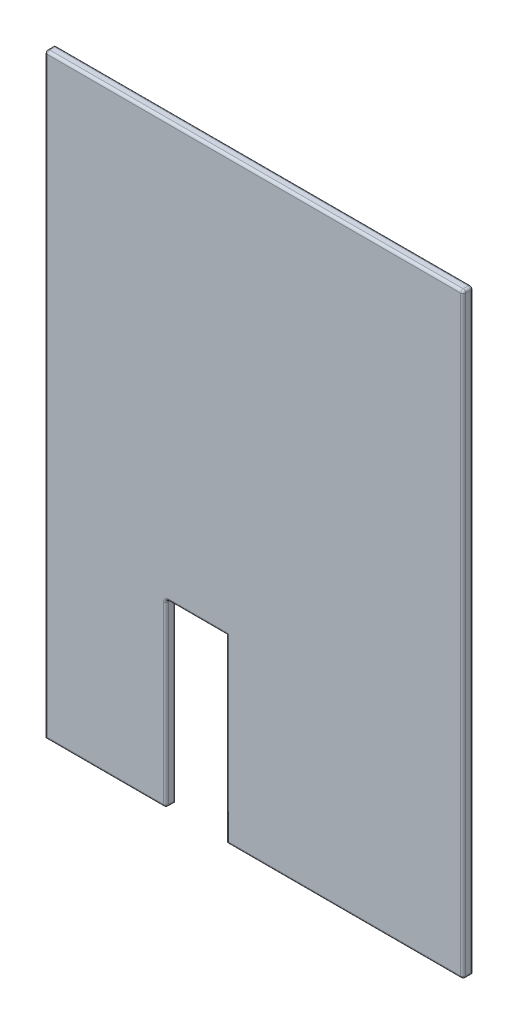
ISO-10303-21;
HEADER;
FILE_DESCRIPTION(('STEP AP214'),'2;1');
FILE_NAME('part.step','',(''),(''),'','','');
FILE_SCHEMA(('AUTOMOTIVE_DESIGN { 1 0 10303 214 1 1 1 1 }'));
ENDSEC;
DATA;
#1=APPLICATION_CONTEXT('core data for automotive mechanical design processes');
#2=APPLICATION_PROTOCOL_DEFINITION('international standard','automotive_design',2000,#1);
#3=PRODUCT_CONTEXT('',#1,'mechanical');
#4=PRODUCT('Part','Part','',(#3));
#5=PRODUCT_RELATED_PRODUCT_CATEGORY('part','',(#4));
#6=PRODUCT_DEFINITION_FORMATION('','',#4);
#7=PRODUCT_DEFINITION_CONTEXT('part definition',#1,'design');
#8=PRODUCT_DEFINITION('design','',#6,#7);
#9=PRODUCT_DEFINITION_SHAPE('','',#8);
#10=(LENGTH_UNIT() NAMED_UNIT(*) SI_UNIT(.MILLI.,.METRE.));
#11=(NAMED_UNIT(*) PLANE_ANGLE_UNIT() SI_UNIT($,.RADIAN.));
#12=(NAMED_UNIT(*) SI_UNIT($,.STERADIAN.) SOLID_ANGLE_UNIT());
#13=UNCERTAINTY_MEASURE_WITH_UNIT(LENGTH_MEASURE(1.E-05),#10,'distance_accuracy_value','');
#14=(GEOMETRIC_REPRESENTATION_CONTEXT(3) GLOBAL_UNCERTAINTY_ASSIGNED_CONTEXT((#13)) GLOBAL_UNIT_ASSIGNED_CONTEXT((#10,
#11,#12)) REPRESENTATION_CONTEXT('',''));
#15=CARTESIAN_POINT('',(0.,0.,0.));
#16=DIRECTION('',(0.,0.,1.));
#17=DIRECTION('',(1.,0.,0.));
#18=AXIS2_PLACEMENT_3D('',#15,#16,#17);
#19=CARTESIAN_POINT('',(-55.5,-595.,20.));
#20=DIRECTION('',(0.,1.,0.));
#21=DIRECTION('',(0.,0.,1.));
#22=AXIS2_PLACEMENT_3D('',#19,#20,#21);
#23=PLANE('',#22);
#24=DIRECTION('',(0.,0.,-1.));
#25=VECTOR('',#24,1.);
#26=CARTESIAN_POINT('',(412.5,-595.,20.));
#27=LINE('',#26,#25);
#28=CARTESIAN_POINT('',(412.5,-595.,0.));
#29=VERTEX_POINT('',#28);
#30=CARTESIAN_POINT('',(412.5,-595.,15.));
#31=VERTEX_POINT('',#30);
#32=EDGE_CURVE('E303',#29,#31,#27,.F.);
#33=ORIENTED_EDGE('',*,*,#32,.T.);
#34=DIRECTION('',(1.,0.,0.));
#35=VECTOR('',#34,1.);
#36=CARTESIAN_POINT('',(-55.5,-595.,15.));
#37=LINE('',#36,#35);
#38=CARTESIAN_POINT('',(-55.5,-595.,15.));
#39=VERTEX_POINT('',#38);
#40=EDGE_CURVE('E306',#31,#39,#37,.F.);
#41=ORIENTED_EDGE('',*,*,#40,.T.);
#42=DIRECTION('',(0.,0.,-1.));
#43=VECTOR('',#42,1.);
#44=CARTESIAN_POINT('',(-55.5,-595.,20.));
#45=LINE('',#44,#43);
#46=CARTESIAN_POINT('',(-55.5,-595.,0.));
#47=VERTEX_POINT('',#46);
#48=EDGE_CURVE('E202',#39,#47,#45,.T.);
#49=ORIENTED_EDGE('',*,*,#48,.T.);
#50=DIRECTION('',(1.,0.,0.));
#51=VECTOR('',#50,1.);
#52=CARTESIAN_POINT('',(-55.5,-595.,0.));
#53=LINE('',#52,#51);
#54=EDGE_CURVE('E192',#47,#29,#53,.T.);
#55=ORIENTED_EDGE('',*,*,#54,.T.);
#56=EDGE_LOOP('',(#33,#41,#49,#55));
#57=FACE_BOUND('',#56,.T.);
#58=ADVANCED_FACE('F39',(#57),#23,.F.);
#59=CARTESIAN_POINT('',(417.5,595.,20.));
#60=DIRECTION('',(-1.,0.,0.));
#61=DIRECTION('',(0.,-1.,0.));
#62=AXIS2_PLACEMENT_3D('',#59,#60,#61);
#63=PLANE('',#62);
#64=DIRECTION('',(0.,1.,0.));
#65=VECTOR('',#64,1.);
#66=CARTESIAN_POINT('',(417.5,595.,5.));
#67=LINE('',#66,#65);
#68=CARTESIAN_POINT('',(417.5,-590.,5.));
#69=VERTEX_POINT('',#68);
#70=CARTESIAN_POINT('',(417.5,590.,5.));
#71=VERTEX_POINT('',#70);
#72=EDGE_CURVE('E241',#69,#71,#67,.T.);
#73=ORIENTED_EDGE('',*,*,#72,.T.);
#74=DIRECTION('',(0.,0.,-1.));
#75=VECTOR('',#74,1.);
#76=CARTESIAN_POINT('',(417.5,590.,20.));
#77=LINE('',#76,#75);
#78=CARTESIAN_POINT('',(417.5,590.,15.));
#79=VERTEX_POINT('',#78);
#80=EDGE_CURVE('E245',#71,#79,#77,.F.);
#81=ORIENTED_EDGE('',*,*,#80,.T.);
#82=DIRECTION('',(0.,1.,0.));
#83=VECTOR('',#82,1.);
#84=CARTESIAN_POINT('',(417.5,595.,15.));
#85=LINE('',#84,#83);
#86=CARTESIAN_POINT('',(417.5,-590.,15.));
#87=VERTEX_POINT('',#86);
#88=EDGE_CURVE('E238',#79,#87,#85,.F.);
#89=ORIENTED_EDGE('',*,*,#88,.T.);
#90=DIRECTION('',(0.,0.,-1.));
#91=VECTOR('',#90,1.);
#92=CARTESIAN_POINT('',(417.5,-590.,20.));
#93=LINE('',#92,#91);
#94=EDGE_CURVE('E235',#87,#69,#93,.T.);
#95=ORIENTED_EDGE('',*,*,#94,.T.);
#96=EDGE_LOOP('',(#73,#81,#89,#95));
#97=FACE_BOUND('',#96,.T.);
#98=ADVANCED_FACE('F518',(#97),#63,.F.);
#99=CARTESIAN_POINT('',(-417.5,595.,20.));
#100=DIRECTION('',(0.,-1.,0.));
#101=DIRECTION('',(0.,0.,-1.));
#102=AXIS2_PLACEMENT_3D('',#99,#100,#101);
#103=PLANE('',#102);
#104=DIRECTION('',(-1.,0.,0.));
#105=VECTOR('',#104,1.);
#106=CARTESIAN_POINT('',(-417.5,595.,5.));
#107=LINE('',#106,#105);
#108=CARTESIAN_POINT('',(412.5,595.,5.));
#109=VERTEX_POINT('',#108);
#110=CARTESIAN_POINT('',(-412.5,595.,5.));
#111=VERTEX_POINT('',#110);
#112=EDGE_CURVE('E254',#109,#111,#107,.T.);
#113=ORIENTED_EDGE('',*,*,#112,.T.);
#114=DIRECTION('',(0.,0.,-1.));
#115=VECTOR('',#114,1.);
#116=CARTESIAN_POINT('',(-412.5,595.,20.));
#117=LINE('',#116,#115);
#118=CARTESIAN_POINT('',(-412.5,595.,15.));
#119=VERTEX_POINT('',#118);
#120=EDGE_CURVE('E258',#111,#119,#117,.F.);
#121=ORIENTED_EDGE('',*,*,#120,.T.);
#122=DIRECTION('',(-1.,0.,0.));
#123=VECTOR('',#122,1.);
#124=CARTESIAN_POINT('',(-417.5,595.,15.));
#125=LINE('',#124,#123);
#126=CARTESIAN_POINT('',(412.5,595.,15.));
#127=VERTEX_POINT('',#126);
#128=EDGE_CURVE('E251',#119,#127,#125,.F.);
#129=ORIENTED_EDGE('',*,*,#128,.T.);
#130=DIRECTION('',(0.,0.,-1.));
#131=VECTOR('',#130,1.);
#132=CARTESIAN_POINT('',(412.5,595.,20.));
#133=LINE('',#132,#131);
#134=EDGE_CURVE('E248',#127,#109,#133,.T.);
#135=ORIENTED_EDGE('',*,*,#134,.T.);
#136=EDGE_LOOP('',(#113,#121,#129,#135));
#137=FACE_BOUND('',#136,.T.);
#138=ADVANCED_FACE('F504',(#137),#103,.F.);
#139=CARTESIAN_POINT('',(-417.5,595.,20.));
#140=DIRECTION('',(1.,0.,0.));
#141=DIRECTION('',(0.,1.,0.));
#142=AXIS2_PLACEMENT_3D('',#139,#140,#141);
#143=PLANE('',#142);
#144=DIRECTION('',(0.,0.,-1.));
#145=VECTOR('',#144,1.);
#146=CARTESIAN_POINT('',(-417.5,-595.,20.));
#147=LINE('',#146,#145);
#148=CARTESIAN_POINT('',(-417.5,-595.,15.));
#149=VERTEX_POINT('',#148);
#150=CARTESIAN_POINT('',(-417.5,-595.,0.));
#151=VERTEX_POINT('',#150);
#152=EDGE_CURVE('E175',#149,#151,#147,.T.);
#153=ORIENTED_EDGE('',*,*,#152,.F.);
#154=DIRECTION('',(0.,-1.,0.));
#155=VECTOR('',#154,1.);
#156=CARTESIAN_POINT('',(-417.5,595.,15.));
#157=LINE('',#156,#155);
#158=CARTESIAN_POINT('',(-417.5,590.,15.));
#159=VERTEX_POINT('',#158);
#160=EDGE_CURVE('E65',#149,#159,#157,.F.);
#161=ORIENTED_EDGE('',*,*,#160,.T.);
#162=DIRECTION('',(0.,0.,-1.));
#163=VECTOR('',#162,1.);
#164=CARTESIAN_POINT('',(-417.5,590.,20.));
#165=LINE('',#164,#163);
#166=CARTESIAN_POINT('',(-417.5,590.,0.));
#167=VERTEX_POINT('',#166);
#168=EDGE_CURVE('E188',#159,#167,#165,.T.);
#169=ORIENTED_EDGE('',*,*,#168,.T.);
#170=DIRECTION('',(0.,-1.,0.));
#171=VECTOR('',#170,1.);
#172=CARTESIAN_POINT('',(-417.5,595.,0.));
#173=LINE('',#172,#171);
#174=EDGE_CURVE('E186',#167,#151,#173,.T.);
#175=ORIENTED_EDGE('',*,*,#174,.T.);
#176=EDGE_LOOP('',(#153,#161,#169,#175));
#177=FACE_BOUND('',#176,.T.);
#178=ADVANCED_FACE('F187',(#177),#143,.F.);
#179=CARTESIAN_POINT('',(-417.5,-595.,20.));
#180=DIRECTION('',(0.,1.,0.));
#181=DIRECTION('',(0.,0.,1.));
#182=AXIS2_PLACEMENT_3D('',#179,#180,#181);
#183=PLANE('',#182);
#184=DIRECTION('',(0.,0.,-1.));
#185=VECTOR('',#184,1.);
#186=CARTESIAN_POINT('',(-180.5,-595.,20.));
#187=LINE('',#186,#185);
#188=CARTESIAN_POINT('',(-180.5,-595.,0.));
#189=VERTEX_POINT('',#188);
#190=CARTESIAN_POINT('',(-180.5,-595.,15.));
#191=VERTEX_POINT('',#190);
#192=EDGE_CURVE('E57',#189,#191,#187,.F.);
#193=ORIENTED_EDGE('',*,*,#192,.T.);
#194=DIRECTION('',(1.,0.,0.));
#195=VECTOR('',#194,1.);
#196=CARTESIAN_POINT('',(-417.5,-595.,15.));
#197=LINE('',#196,#195);
#198=EDGE_CURVE('E180',#191,#149,#197,.F.);
#199=ORIENTED_EDGE('',*,*,#198,.T.);
#200=ORIENTED_EDGE('',*,*,#152,.T.);
#201=DIRECTION('',(1.,0.,0.));
#202=VECTOR('',#201,1.);
#203=CARTESIAN_POINT('',(-417.5,-595.,0.));
#204=LINE('',#203,#202);
#205=EDGE_CURVE('E179',#151,#189,#204,.T.);
#206=ORIENTED_EDGE('',*,*,#205,.T.);
#207=EDGE_LOOP('',(#193,#199,#200,#206));
#208=FACE_BOUND('',#207,.T.);
#209=ADVANCED_FACE('F177',(#208),#183,.F.);
#210=CARTESIAN_POINT('',(-175.5,-595.,20.));
#211=DIRECTION('',(-1.,0.,0.));
#212=DIRECTION('',(0.,0.,1.));
#213=AXIS2_PLACEMENT_3D('',#210,#211,#212);
#214=PLANE('',#213);
#215=DIRECTION('',(0.,1.,0.));
#216=VECTOR('',#215,1.);
#217=CARTESIAN_POINT('',(-175.5,-235.,5.));
#218=LINE('',#217,#216);
#219=CARTESIAN_POINT('',(-175.5,-590.,5.));
#220=VERTEX_POINT('',#219);
#221=CARTESIAN_POINT('',(-175.5,-240.,5.));
#222=VERTEX_POINT('',#221);
#223=EDGE_CURVE('E267',#220,#222,#218,.T.);
#224=ORIENTED_EDGE('',*,*,#223,.T.);
#225=DIRECTION('',(0.,0.,-1.));
#226=VECTOR('',#225,1.);
#227=CARTESIAN_POINT('',(-175.5,-240.,20.));
#228=LINE('',#227,#226);
#229=CARTESIAN_POINT('',(-175.5,-240.,15.));
#230=VERTEX_POINT('',#229);
#231=EDGE_CURVE('E271',#222,#230,#228,.F.);
#232=ORIENTED_EDGE('',*,*,#231,.T.);
#233=DIRECTION('',(0.,1.,0.));
#234=VECTOR('',#233,1.);
#235=CARTESIAN_POINT('',(-175.5,-595.,15.));
#236=LINE('',#235,#234);
#237=CARTESIAN_POINT('',(-175.5,-590.,15.));
#238=VERTEX_POINT('',#237);
#239=EDGE_CURVE('E264',#230,#238,#236,.F.);
#240=ORIENTED_EDGE('',*,*,#239,.T.);
#241=DIRECTION('',(0.,0.,-1.));
#242=VECTOR('',#241,1.);
#243=CARTESIAN_POINT('',(-175.5,-590.,20.));
#244=LINE('',#243,#242);
#245=EDGE_CURVE('E261',#238,#220,#244,.T.);
#246=ORIENTED_EDGE('',*,*,#245,.T.);
#247=EDGE_LOOP('',(#224,#232,#240,#246));
#248=FACE_BOUND('',#247,.T.);
#249=ADVANCED_FACE('F595',(#248),#214,.F.);
#250=CARTESIAN_POINT('',(-175.5,-235.,20.));
#251=DIRECTION('',(0.,1.,0.));
#252=DIRECTION('',(-1.,0.,0.));
#253=AXIS2_PLACEMENT_3D('',#250,#251,#252);
#254=PLANE('',#253);
#255=DIRECTION('',(0.,0.,-1.));
#256=VECTOR('',#255,1.);
#257=CARTESIAN_POINT('',(-170.5,-235.,0.));
#258=LINE('',#257,#256);
#259=CARTESIAN_POINT('',(-170.5,-235.,15.));
#260=VERTEX_POINT('',#259);
#261=CARTESIAN_POINT('',(-170.5,-235.,5.));
#262=VERTEX_POINT('',#261);
#263=EDGE_CURVE('E182',#260,#262,#258,.T.);
#264=ORIENTED_EDGE('',*,*,#263,.T.);
#265=DIRECTION('',(1.,0.,0.));
#266=VECTOR('',#265,1.);
#267=CARTESIAN_POINT('',(-55.5000000000001,-235.,5.));
#268=LINE('',#267,#266);
#269=CARTESIAN_POINT('',(-55.5000000000001,-235.,5.));
#270=VERTEX_POINT('',#269);
#271=EDGE_CURVE('E216',#262,#270,#268,.T.);
#272=ORIENTED_EDGE('',*,*,#271,.T.);
#273=DIRECTION('',(0.,0.,-1.));
#274=VECTOR('',#273,1.);
#275=CARTESIAN_POINT('',(-55.5000000000001,-235.,20.));
#276=LINE('',#275,#274);
#277=CARTESIAN_POINT('',(-55.5000000000001,-235.,15.));
#278=VERTEX_POINT('',#277);
#279=EDGE_CURVE('E183',#278,#270,#276,.T.);
#280=ORIENTED_EDGE('',*,*,#279,.F.);
#281=DIRECTION('',(1.,0.,0.));
#282=VECTOR('',#281,1.);
#283=CARTESIAN_POINT('',(-175.5,-235.,15.));
#284=LINE('',#283,#282);
#285=EDGE_CURVE('E213',#278,#260,#284,.F.);
#286=ORIENTED_EDGE('',*,*,#285,.T.);
#287=EDGE_LOOP('',(#264,#272,#280,#286));
#288=FACE_BOUND('',#287,.T.);
#289=ADVANCED_FACE('F465',(#288),#254,.F.);
#290=CARTESIAN_POINT('',(-55.5000000000001,-235.,20.));
#291=DIRECTION('',(1.,0.,0.));
#292=DIRECTION('',(0.,1.,0.));
#293=AXIS2_PLACEMENT_3D('',#290,#291,#292);
#294=PLANE('',#293);
#295=ORIENTED_EDGE('',*,*,#48,.F.);
#296=DIRECTION('',(0.,-1.,0.));
#297=VECTOR('',#296,1.);
#298=CARTESIAN_POINT('',(-55.5000000000001,-235.,15.));
#299=LINE('',#298,#297);
#300=EDGE_CURVE('E49',#39,#278,#299,.F.);
#301=ORIENTED_EDGE('',*,*,#300,.T.);
#302=ORIENTED_EDGE('',*,*,#279,.T.);
#303=CARTESIAN_POINT('',(-55.5000000000001,-230.,5.));
#304=DIRECTION('',(1.,0.,0.));
#305=DIRECTION('',(0.,1.,0.));
#306=AXIS2_PLACEMENT_3D('',#303,#304,#305);
#307=CIRCLE('',#306,5.);
#308=CARTESIAN_POINT('',(-55.5000000000001,-230.,0.));
#309=VERTEX_POINT('',#308);
#310=EDGE_CURVE('E11',#270,#309,#307,.T.);
#311=ORIENTED_EDGE('',*,*,#310,.T.);
#312=DIRECTION('',(0.,-1.,0.));
#313=VECTOR('',#312,1.);
#314=CARTESIAN_POINT('',(-55.5000000000001,-235.,0.));
#315=LINE('',#314,#313);
#316=EDGE_CURVE('E198',#309,#47,#315,.T.);
#317=ORIENTED_EDGE('',*,*,#316,.T.);
#318=EDGE_LOOP('',(#295,#301,#302,#311,#317));
#319=FACE_BOUND('',#318,.T.);
#320=ADVANCED_FACE('F454',(#319),#294,.F.);
#321=CARTESIAN_POINT('',(0.,0.,20.));
#322=DIRECTION('',(0.,0.,-1.));
#323=DIRECTION('',(-1.,0.,0.));
#324=AXIS2_PLACEMENT_3D('',#321,#322,#323);
#325=PLANE('',#324);
#326=DIRECTION('',(0.,-1.,0.));
#327=VECTOR('',#326,1.);
#328=CARTESIAN_POINT('',(-50.5000000000002,0.,20.));
#329=LINE('',#328,#327);
#330=CARTESIAN_POINT('',(-50.5000000000001,-230.,20.));
#331=VERTEX_POINT('',#330);
#332=CARTESIAN_POINT('',(-50.5,-590.,20.));
#333=VERTEX_POINT('',#332);
#334=EDGE_CURVE('E274',#331,#333,#329,.T.);
#335=ORIENTED_EDGE('',*,*,#334,.T.);
#336=DIRECTION('',(1.,0.,0.));
#337=VECTOR('',#336,1.);
#338=CARTESIAN_POINT('',(0.,-590.,20.));
#339=LINE('',#338,#337);
#340=CARTESIAN_POINT('',(412.5,-590.,20.));
#341=VERTEX_POINT('',#340);
#342=EDGE_CURVE('E299',#333,#341,#339,.T.);
#343=ORIENTED_EDGE('',*,*,#342,.T.);
#344=DIRECTION('',(0.,1.,0.));
#345=VECTOR('',#344,1.);
#346=CARTESIAN_POINT('',(412.5,0.,20.));
#347=LINE('',#346,#345);
#348=CARTESIAN_POINT('',(412.5,590.,20.));
#349=VERTEX_POINT('',#348);
#350=EDGE_CURVE('E296',#341,#349,#347,.T.);
#351=ORIENTED_EDGE('',*,*,#350,.T.);
#352=DIRECTION('',(-1.,0.,0.));
#353=VECTOR('',#352,1.);
#354=CARTESIAN_POINT('',(0.,590.,20.));
#355=LINE('',#354,#353);
#356=CARTESIAN_POINT('',(-412.5,590.,20.));
#357=VERTEX_POINT('',#356);
#358=EDGE_CURVE('E293',#349,#357,#355,.T.);
#359=ORIENTED_EDGE('',*,*,#358,.T.);
#360=DIRECTION('',(0.,-1.,0.));
#361=VECTOR('',#360,1.);
#362=CARTESIAN_POINT('',(-412.5,0.,20.));
#363=LINE('',#362,#361);
#364=CARTESIAN_POINT('',(-412.5,-590.,20.));
#365=VERTEX_POINT('',#364);
#366=EDGE_CURVE('E290',#357,#365,#363,.T.);
#367=ORIENTED_EDGE('',*,*,#366,.T.);
#368=DIRECTION('',(1.,0.,0.));
#369=VECTOR('',#368,1.);
#370=CARTESIAN_POINT('',(0.,-590.,20.));
#371=LINE('',#370,#369);
#372=CARTESIAN_POINT('',(-180.5,-590.,20.));
#373=VERTEX_POINT('',#372);
#374=EDGE_CURVE('E287',#365,#373,#371,.T.);
#375=ORIENTED_EDGE('',*,*,#374,.T.);
#376=DIRECTION('',(0.,1.,0.));
#377=VECTOR('',#376,1.);
#378=CARTESIAN_POINT('',(-180.5,0.,20.));
#379=LINE('',#378,#377);
#380=CARTESIAN_POINT('',(-180.5,-240.,20.));
#381=VERTEX_POINT('',#380);
#382=EDGE_CURVE('E284',#373,#381,#379,.T.);
#383=ORIENTED_EDGE('',*,*,#382,.T.);
#384=CARTESIAN_POINT('',(-170.5,-240.,20.));
#385=DIRECTION('',(0.,0.,-1.));
#386=DIRECTION('',(-1.,0.,0.));
#387=AXIS2_PLACEMENT_3D('',#384,#385,#386);
#388=CIRCLE('',#387,10.);
#389=CARTESIAN_POINT('',(-170.5,-230.,20.));
#390=VERTEX_POINT('',#389);
#391=EDGE_CURVE('E280',#390,#381,#388,.F.);
#392=ORIENTED_EDGE('',*,*,#391,.F.);
#393=DIRECTION('',(1.,0.,0.));
#394=VECTOR('',#393,1.);
#395=CARTESIAN_POINT('',(0.,-230.,20.));
#396=LINE('',#395,#394);
#397=EDGE_CURVE('E277',#390,#331,#396,.T.);
#398=ORIENTED_EDGE('',*,*,#397,.T.);
#399=EDGE_LOOP('',(#335,#343,#351,#359,#367,#375,#383,#392,#398));
#400=FACE_BOUND('',#399,.T.);
#401=ADVANCED_FACE('F588',(#400),#325,.F.);
#402=CARTESIAN_POINT('',(0.,0.,0.));
#403=DIRECTION('',(0.,0.,-1.));
#404=DIRECTION('',(-1.,0.,0.));
#405=AXIS2_PLACEMENT_3D('',#402,#403,#404);
#406=PLANE('',#405);
#407=DIRECTION('',(-1.,0.,0.));
#408=VECTOR('',#407,1.);
#409=CARTESIAN_POINT('',(417.5,590.,0.));
#410=LINE('',#409,#408);
#411=CARTESIAN_POINT('',(412.5,590.,0.));
#412=VERTEX_POINT('',#411);
#413=EDGE_CURVE('E229',#167,#412,#410,.F.);
#414=ORIENTED_EDGE('',*,*,#413,.T.);
#415=DIRECTION('',(0.,1.,0.));
#416=VECTOR('',#415,1.);
#417=CARTESIAN_POINT('',(412.5,-595.,0.));
#418=LINE('',#417,#416);
#419=EDGE_CURVE('E232',#412,#29,#418,.F.);
#420=ORIENTED_EDGE('',*,*,#419,.T.);
#421=ORIENTED_EDGE('',*,*,#54,.F.);
#422=ORIENTED_EDGE('',*,*,#316,.F.);
#423=DIRECTION('',(1.,0.,0.));
#424=VECTOR('',#423,1.);
#425=CARTESIAN_POINT('',(-175.5,-230.,0.));
#426=LINE('',#425,#424);
#427=CARTESIAN_POINT('',(-170.5,-230.,0.));
#428=VERTEX_POINT('',#427);
#429=EDGE_CURVE('E226',#309,#428,#426,.F.);
#430=ORIENTED_EDGE('',*,*,#429,.T.);
#431=CARTESIAN_POINT('',(-170.5,-240.,0.));
#432=DIRECTION('',(0.,0.,-1.));
#433=DIRECTION('',(-1.,0.,0.));
#434=AXIS2_PLACEMENT_3D('',#431,#432,#433);
#435=CIRCLE('',#434,10.);
#436=CARTESIAN_POINT('',(-180.5,-240.,0.));
#437=VERTEX_POINT('',#436);
#438=EDGE_CURVE('E222',#437,#428,#435,.T.);
#439=ORIENTED_EDGE('',*,*,#438,.F.);
#440=DIRECTION('',(0.,1.,0.));
#441=VECTOR('',#440,1.);
#442=CARTESIAN_POINT('',(-180.5,-595.,0.));
#443=LINE('',#442,#441);
#444=EDGE_CURVE('E196',#437,#189,#443,.F.);
#445=ORIENTED_EDGE('',*,*,#444,.T.);
#446=ORIENTED_EDGE('',*,*,#205,.F.);
#447=ORIENTED_EDGE('',*,*,#174,.F.);
#448=EDGE_LOOP('',(#414,#420,#421,#422,#430,#439,#445,#446,#447));
#449=FACE_BOUND('',#448,.T.);
#450=ADVANCED_FACE('F194',(#449),#406,.T.);
#451=CARTESIAN_POINT('',(412.5,590.,20.));
#452=DIRECTION('',(0.,0.,-1.));
#453=DIRECTION('',(-1.,0.,0.));
#454=AXIS2_PLACEMENT_3D('',#451,#452,#453);
#455=CYLINDRICAL_SURFACE('',#454,5.);
#456=CARTESIAN_POINT('',(412.5,590.,5.));
#457=DIRECTION('',(0.,0.,-1.));
#458=DIRECTION('',(-1.,0.,0.));
#459=AXIS2_PLACEMENT_3D('',#456,#457,#458);
#460=CIRCLE('',#459,5.);
#461=EDGE_CURVE('E43',#109,#71,#460,.T.);
#462=ORIENTED_EDGE('',*,*,#461,.F.);
#463=ORIENTED_EDGE('',*,*,#134,.F.);
#464=CARTESIAN_POINT('',(412.5,590.,15.));
#465=DIRECTION('',(0.,0.,1.));
#466=DIRECTION('',(1.,0.,0.));
#467=AXIS2_PLACEMENT_3D('',#464,#465,#466);
#468=CIRCLE('',#467,5.);
#469=EDGE_CURVE('E412',#79,#127,#468,.T.);
#470=ORIENTED_EDGE('',*,*,#469,.F.);
#471=ORIENTED_EDGE('',*,*,#80,.F.);
#472=EDGE_LOOP('',(#462,#463,#470,#471));
#473=FACE_BOUND('',#472,.T.);
#474=ADVANCED_FACE('F41',(#473),#455,.T.);
#475=CARTESIAN_POINT('',(412.5,590.,5.));
#476=DIRECTION('',(0.,1.,0.));
#477=DIRECTION('',(0.,0.,1.));
#478=AXIS2_PLACEMENT_3D('',#475,#476,#477);
#479=SPHERICAL_SURFACE('',#478,5.);
#480=CARTESIAN_POINT('',(412.5,590.,5.));
#481=DIRECTION('',(0.,1.,0.));
#482=DIRECTION('',(0.,0.,1.));
#483=AXIS2_PLACEMENT_3D('',#480,#481,#482);
#484=CIRCLE('',#483,5.);
#485=EDGE_CURVE('E409',#412,#71,#484,.F.);
#486=ORIENTED_EDGE('',*,*,#485,.F.);
#487=CARTESIAN_POINT('',(412.5,590.,5.));
#488=DIRECTION('',(1.,0.,0.));
#489=DIRECTION('',(0.,0.,-1.));
#490=AXIS2_PLACEMENT_3D('',#487,#488,#489);
#491=CIRCLE('',#490,5.);
#492=EDGE_CURVE('E415',#109,#412,#491,.F.);
#493=ORIENTED_EDGE('',*,*,#492,.F.);
#494=ORIENTED_EDGE('',*,*,#461,.T.);
#495=EDGE_LOOP('',(#486,#493,#494));
#496=FACE_BOUND('',#495,.T.);
#497=ADVANCED_FACE('F509',(#496),#479,.T.);
#498=CARTESIAN_POINT('',(-417.5,590.,5.));
#499=DIRECTION('',(1.,0.,0.));
#500=DIRECTION('',(0.,0.,-1.));
#501=AXIS2_PLACEMENT_3D('',#498,#499,#500);
#502=CYLINDRICAL_SURFACE('',#501,5.);
#503=ORIENTED_EDGE('',*,*,#492,.T.);
#504=ORIENTED_EDGE('',*,*,#413,.F.);
#505=CARTESIAN_POINT('',(-412.5,590.,5.));
#506=DIRECTION('',(0.707106781186547,0.,-0.707106781186547));
#507=DIRECTION('',(-0.707106781186547,0.,-0.707106781186547));
#508=AXIS2_PLACEMENT_3D('',#505,#506,#507);
#509=ELLIPSE('',#508,7.07106781186547,5.);
#510=EDGE_CURVE('E405',#111,#167,#509,.F.);
#511=ORIENTED_EDGE('',*,*,#510,.F.);
#512=ORIENTED_EDGE('',*,*,#112,.F.);
#513=EDGE_LOOP('',(#503,#504,#511,#512));
#514=FACE_BOUND('',#513,.T.);
#515=ADVANCED_FACE('F502',(#514),#502,.T.);
#516=CARTESIAN_POINT('',(412.5,590.,15.));
#517=DIRECTION('',(0.,1.,0.));
#518=DIRECTION('',(0.,0.,1.));
#519=AXIS2_PLACEMENT_3D('',#516,#517,#518);
#520=SPHERICAL_SURFACE('',#519,5.);
#521=CARTESIAN_POINT('',(412.5,590.,15.));
#522=DIRECTION('',(0.,1.,0.));
#523=DIRECTION('',(0.,0.,1.));
#524=AXIS2_PLACEMENT_3D('',#521,#522,#523);
#525=CIRCLE('',#524,5.);
#526=EDGE_CURVE('E397',#79,#349,#525,.F.);
#527=ORIENTED_EDGE('',*,*,#526,.F.);
#528=ORIENTED_EDGE('',*,*,#469,.T.);
#529=CARTESIAN_POINT('',(412.5,590.,15.));
#530=DIRECTION('',(1.,0.,0.));
#531=DIRECTION('',(0.,0.,-1.));
#532=AXIS2_PLACEMENT_3D('',#529,#530,#531);
#533=CIRCLE('',#532,5.);
#534=EDGE_CURVE('E401',#349,#127,#533,.F.);
#535=ORIENTED_EDGE('',*,*,#534,.F.);
#536=EDGE_LOOP('',(#527,#528,#535));
#537=FACE_BOUND('',#536,.T.);
#538=ADVANCED_FACE('F515',(#537),#520,.T.);
#539=CARTESIAN_POINT('',(412.5,595.,5.));
#540=DIRECTION('',(0.,-1.,0.));
#541=DIRECTION('',(1.,0.,0.));
#542=AXIS2_PLACEMENT_3D('',#539,#540,#541);
#543=CYLINDRICAL_SURFACE('',#542,5.);
#544=ORIENTED_EDGE('',*,*,#485,.T.);
#545=ORIENTED_EDGE('',*,*,#72,.F.);
#546=CARTESIAN_POINT('',(412.5,-590.,5.));
#547=DIRECTION('',(0.,0.707106781186547,-0.707106781186547));
#548=DIRECTION('',(0.,-0.707106781186547,-0.707106781186547));
#549=AXIS2_PLACEMENT_3D('',#546,#547,#548);
#550=ELLIPSE('',#549,7.07106781186547,5.);
#551=EDGE_CURVE('E393',#29,#69,#550,.F.);
#552=ORIENTED_EDGE('',*,*,#551,.F.);
#553=ORIENTED_EDGE('',*,*,#419,.F.);
#554=EDGE_LOOP('',(#544,#545,#552,#553));
#555=FACE_BOUND('',#554,.T.);
#556=ADVANCED_FACE('F438',(#555),#543,.T.);
#557=CARTESIAN_POINT('',(-412.5,590.,20.));
#558=DIRECTION('',(0.,0.,-1.));
#559=DIRECTION('',(-1.,0.,0.));
#560=AXIS2_PLACEMENT_3D('',#557,#558,#559);
#561=CYLINDRICAL_SURFACE('',#560,5.);
#562=ORIENTED_EDGE('',*,*,#510,.T.);
#563=ORIENTED_EDGE('',*,*,#168,.F.);
#564=CARTESIAN_POINT('',(-412.5,590.,15.));
#565=DIRECTION('',(0.,0.,1.));
#566=DIRECTION('',(1.,0.,0.));
#567=AXIS2_PLACEMENT_3D('',#564,#565,#566);
#568=CIRCLE('',#567,5.);
#569=EDGE_CURVE('E389',#119,#159,#568,.T.);
#570=ORIENTED_EDGE('',*,*,#569,.F.);
#571=ORIENTED_EDGE('',*,*,#120,.F.);
#572=EDGE_LOOP('',(#562,#563,#570,#571));
#573=FACE_BOUND('',#572,.T.);
#574=ADVANCED_FACE('F500',(#573),#561,.T.);
#575=CARTESIAN_POINT('',(0.,590.,15.));
#576=DIRECTION('',(-1.,0.,0.));
#577=DIRECTION('',(0.,0.,1.));
#578=AXIS2_PLACEMENT_3D('',#575,#576,#577);
#579=CYLINDRICAL_SURFACE('',#578,5.);
#580=ORIENTED_EDGE('',*,*,#534,.T.);
#581=ORIENTED_EDGE('',*,*,#128,.F.);
#582=CARTESIAN_POINT('',(-412.5,590.,15.));
#583=DIRECTION('',(-1.,0.,0.));
#584=DIRECTION('',(0.,-1.,0.));
#585=AXIS2_PLACEMENT_3D('',#582,#583,#584);
#586=CIRCLE('',#585,5.);
#587=EDGE_CURVE('E385',#357,#119,#586,.T.);
#588=ORIENTED_EDGE('',*,*,#587,.F.);
#589=ORIENTED_EDGE('',*,*,#358,.F.);
#590=EDGE_LOOP('',(#580,#581,#588,#589));
#591=FACE_BOUND('',#590,.T.);
#592=ADVANCED_FACE('F570',(#591),#579,.T.);
#593=CARTESIAN_POINT('',(412.5,0.,15.));
#594=DIRECTION('',(0.,1.,0.));
#595=DIRECTION('',(-1.,0.,0.));
#596=AXIS2_PLACEMENT_3D('',#593,#594,#595);
#597=CYLINDRICAL_SURFACE('',#596,5.);
#598=ORIENTED_EDGE('',*,*,#526,.T.);
#599=ORIENTED_EDGE('',*,*,#350,.F.);
#600=CARTESIAN_POINT('',(412.5,-590.,15.));
#601=DIRECTION('',(0.,-1.,0.));
#602=DIRECTION('',(0.,0.,-1.));
#603=AXIS2_PLACEMENT_3D('',#600,#601,#602);
#604=CIRCLE('',#603,5.);
#605=EDGE_CURVE('E381',#87,#341,#604,.T.);
#606=ORIENTED_EDGE('',*,*,#605,.F.);
#607=ORIENTED_EDGE('',*,*,#88,.F.);
#608=EDGE_LOOP('',(#598,#599,#606,#607));
#609=FACE_BOUND('',#608,.T.);
#610=ADVANCED_FACE('F567',(#609),#597,.T.);
#611=CARTESIAN_POINT('',(412.5,-590.,20.));
#612=DIRECTION('',(0.,0.,-1.));
#613=DIRECTION('',(-1.,0.,0.));
#614=AXIS2_PLACEMENT_3D('',#611,#612,#613);
#615=CYLINDRICAL_SURFACE('',#614,5.);
#616=ORIENTED_EDGE('',*,*,#551,.T.);
#617=ORIENTED_EDGE('',*,*,#94,.F.);
#618=CARTESIAN_POINT('',(412.5,-590.,15.));
#619=DIRECTION('',(0.,0.,1.));
#620=DIRECTION('',(1.,0.,0.));
#621=AXIS2_PLACEMENT_3D('',#618,#619,#620);
#622=CIRCLE('',#621,5.);
#623=EDGE_CURVE('E377',#31,#87,#622,.T.);
#624=ORIENTED_EDGE('',*,*,#623,.F.);
#625=ORIENTED_EDGE('',*,*,#32,.F.);
#626=EDGE_LOOP('',(#616,#617,#624,#625));
#627=FACE_BOUND('',#626,.T.);
#628=ADVANCED_FACE('F441',(#627),#615,.T.);
#629=CARTESIAN_POINT('',(-412.5,590.,15.));
#630=DIRECTION('',(0.,1.,0.));
#631=DIRECTION('',(0.,0.,1.));
#632=AXIS2_PLACEMENT_3D('',#629,#630,#631);
#633=SPHERICAL_SURFACE('',#632,5.);
#634=ORIENTED_EDGE('',*,*,#587,.T.);
#635=ORIENTED_EDGE('',*,*,#569,.T.);
#636=CARTESIAN_POINT('',(-412.5,590.,15.));
#637=DIRECTION('',(0.,1.,0.));
#638=DIRECTION('',(0.,0.,1.));
#639=AXIS2_PLACEMENT_3D('',#636,#637,#638);
#640=CIRCLE('',#639,5.);
#641=EDGE_CURVE('E373',#357,#159,#640,.F.);
#642=ORIENTED_EDGE('',*,*,#641,.F.);
#643=EDGE_LOOP('',(#634,#635,#642));
#644=FACE_BOUND('',#643,.T.);
#645=ADVANCED_FACE('F496',(#644),#633,.T.);
#646=CARTESIAN_POINT('',(412.5,-590.,15.));
#647=DIRECTION('',(1.,0.,0.));
#648=DIRECTION('',(0.,1.,0.));
#649=AXIS2_PLACEMENT_3D('',#646,#647,#648);
#650=SPHERICAL_SURFACE('',#649,5.);
#651=ORIENTED_EDGE('',*,*,#623,.T.);
#652=ORIENTED_EDGE('',*,*,#605,.T.);
#653=CARTESIAN_POINT('',(412.5,-590.,15.));
#654=DIRECTION('',(1.,0.,0.));
#655=DIRECTION('',(0.,0.,-1.));
#656=AXIS2_PLACEMENT_3D('',#653,#654,#655);
#657=CIRCLE('',#656,5.);
#658=EDGE_CURVE('E370',#31,#341,#657,.F.);
#659=ORIENTED_EDGE('',*,*,#658,.F.);
#660=EDGE_LOOP('',(#651,#652,#659));
#661=FACE_BOUND('',#660,.T.);
#662=ADVANCED_FACE('F446',(#661),#650,.T.);
#663=CARTESIAN_POINT('',(-412.5,0.,15.));
#664=DIRECTION('',(0.,-1.,0.));
#665=DIRECTION('',(1.,0.,0.));
#666=AXIS2_PLACEMENT_3D('',#663,#664,#665);
#667=CYLINDRICAL_SURFACE('',#666,5.);
#668=ORIENTED_EDGE('',*,*,#641,.T.);
#669=ORIENTED_EDGE('',*,*,#160,.F.);
#670=CARTESIAN_POINT('',(-412.5,-590.,15.));
#671=DIRECTION('',(0.707106781186548,-0.707106781186547,0.));
#672=DIRECTION('',(0.707106781186547,0.707106781186548,0.));
#673=AXIS2_PLACEMENT_3D('',#670,#671,#672);
#674=ELLIPSE('',#673,7.07106781186547,5.);
#675=EDGE_CURVE('E366',#365,#149,#674,.T.);
#676=ORIENTED_EDGE('',*,*,#675,.F.);
#677=ORIENTED_EDGE('',*,*,#366,.F.);
#678=EDGE_LOOP('',(#668,#669,#676,#677));
#679=FACE_BOUND('',#678,.T.);
#680=ADVANCED_FACE('F493',(#679),#667,.T.);
#681=CARTESIAN_POINT('',(0.,-590.,15.));
#682=DIRECTION('',(1.,0.,0.));
#683=DIRECTION('',(0.,0.,-1.));
#684=AXIS2_PLACEMENT_3D('',#681,#682,#683);
#685=CYLINDRICAL_SURFACE('',#684,5.);
#686=ORIENTED_EDGE('',*,*,#658,.T.);
#687=ORIENTED_EDGE('',*,*,#342,.F.);
#688=CARTESIAN_POINT('',(-50.5,-590.,15.));
#689=DIRECTION('',(0.707106781186548,-0.707106781186547,0.));
#690=DIRECTION('',(-0.707106781186547,-0.707106781186548,0.));
#691=AXIS2_PLACEMENT_3D('',#688,#689,#690);
#692=ELLIPSE('',#691,7.07106781186547,5.);
#693=EDGE_CURVE('E362',#39,#333,#692,.F.);
#694=ORIENTED_EDGE('',*,*,#693,.F.);
#695=ORIENTED_EDGE('',*,*,#40,.F.);
#696=EDGE_LOOP('',(#686,#687,#694,#695));
#697=FACE_BOUND('',#696,.T.);
#698=ADVANCED_FACE('F451',(#697),#685,.T.);
#699=CARTESIAN_POINT('',(0.,-590.,15.));
#700=DIRECTION('',(1.,0.,0.));
#701=DIRECTION('',(0.,0.,-1.));
#702=AXIS2_PLACEMENT_3D('',#699,#700,#701);
#703=CYLINDRICAL_SURFACE('',#702,5.);
#704=ORIENTED_EDGE('',*,*,#675,.T.);
#705=ORIENTED_EDGE('',*,*,#198,.F.);
#706=CARTESIAN_POINT('',(-180.5,-590.,15.));
#707=DIRECTION('',(1.,0.,0.));
#708=DIRECTION('',(0.,0.,-1.));
#709=AXIS2_PLACEMENT_3D('',#706,#707,#708);
#710=CIRCLE('',#709,5.);
#711=EDGE_CURVE('E358',#373,#191,#710,.T.);
#712=ORIENTED_EDGE('',*,*,#711,.F.);
#713=ORIENTED_EDGE('',*,*,#374,.F.);
#714=EDGE_LOOP('',(#704,#705,#712,#713));
#715=FACE_BOUND('',#714,.T.);
#716=ADVANCED_FACE('F489',(#715),#703,.T.);
#717=CARTESIAN_POINT('',(-50.5000000000002,0.,15.));
#718=DIRECTION('',(0.,-1.,0.));
#719=DIRECTION('',(1.,0.,0.));
#720=AXIS2_PLACEMENT_3D('',#717,#718,#719);
#721=CYLINDRICAL_SURFACE('',#720,5.);
#722=ORIENTED_EDGE('',*,*,#693,.T.);
#723=ORIENTED_EDGE('',*,*,#334,.F.);
#724=CARTESIAN_POINT('',(-50.5000000000001,-230.,15.));
#725=DIRECTION('',(0.707106781186548,-0.707106781186547,0.));
#726=DIRECTION('',(0.707106781186547,0.707106781186548,0.));
#727=AXIS2_PLACEMENT_3D('',#724,#725,#726);
#728=ELLIPSE('',#727,7.07106781186547,5.);
#729=EDGE_CURVE('E350',#278,#331,#728,.F.);
#730=ORIENTED_EDGE('',*,*,#729,.F.);
#731=ORIENTED_EDGE('',*,*,#300,.F.);
#732=EDGE_LOOP('',(#722,#723,#730,#731));
#733=FACE_BOUND('',#732,.T.);
#734=ADVANCED_FACE('F551',(#733),#721,.T.);
#735=CARTESIAN_POINT('',(-180.5,-590.,15.));
#736=DIRECTION('',(0.,0.,1.));
#737=DIRECTION('',(1.,0.,0.));
#738=AXIS2_PLACEMENT_3D('',#735,#736,#737);
#739=SPHERICAL_SURFACE('',#738,5.);
#740=CARTESIAN_POINT('',(-180.5,-590.,15.));
#741=DIRECTION('',(0.,0.,1.));
#742=DIRECTION('',(1.,0.,0.));
#743=AXIS2_PLACEMENT_3D('',#740,#741,#742);
#744=CIRCLE('',#743,5.);
#745=EDGE_CURVE('E346',#238,#191,#744,.F.);
#746=ORIENTED_EDGE('',*,*,#745,.F.);
#747=CARTESIAN_POINT('',(-180.5,-590.,15.));
#748=DIRECTION('',(0.,-1.,0.));
#749=DIRECTION('',(0.,0.,-1.));
#750=AXIS2_PLACEMENT_3D('',#747,#748,#749);
#751=CIRCLE('',#750,5.);
#752=EDGE_CURVE('E354',#373,#238,#751,.F.);
#753=ORIENTED_EDGE('',*,*,#752,.F.);
#754=ORIENTED_EDGE('',*,*,#711,.T.);
#755=EDGE_LOOP('',(#746,#753,#754));
#756=FACE_BOUND('',#755,.T.);
#757=ADVANCED_FACE('F484',(#756),#739,.T.);
#758=CARTESIAN_POINT('',(-180.5,0.,15.));
#759=DIRECTION('',(0.,1.,0.));
#760=DIRECTION('',(0.,0.,1.));
#761=AXIS2_PLACEMENT_3D('',#758,#759,#760);
#762=CYLINDRICAL_SURFACE('',#761,5.);
#763=ORIENTED_EDGE('',*,*,#752,.T.);
#764=ORIENTED_EDGE('',*,*,#239,.F.);
#765=CARTESIAN_POINT('',(-180.5,-240.,15.));
#766=DIRECTION('',(0.,1.,0.));
#767=DIRECTION('',(0.,0.,1.));
#768=AXIS2_PLACEMENT_3D('',#765,#766,#767);
#769=CIRCLE('',#768,5.);
#770=EDGE_CURVE('E342',#381,#230,#769,.T.);
#771=ORIENTED_EDGE('',*,*,#770,.F.);
#772=ORIENTED_EDGE('',*,*,#382,.F.);
#773=EDGE_LOOP('',(#763,#764,#771,#772));
#774=FACE_BOUND('',#773,.T.);
#775=ADVANCED_FACE('F544',(#774),#762,.T.);
#776=CARTESIAN_POINT('',(0.,-230.,15.));
#777=DIRECTION('',(1.,0.,0.));
#778=DIRECTION('',(0.,1.,0.));
#779=AXIS2_PLACEMENT_3D('',#776,#777,#778);
#780=CYLINDRICAL_SURFACE('',#779,5.);
#781=ORIENTED_EDGE('',*,*,#729,.T.);
#782=ORIENTED_EDGE('',*,*,#397,.F.);
#783=CARTESIAN_POINT('',(-170.5,-230.,15.));
#784=DIRECTION('',(-1.,0.,0.));
#785=DIRECTION('',(0.,0.,1.));
#786=AXIS2_PLACEMENT_3D('',#783,#784,#785);
#787=CIRCLE('',#786,5.);
#788=EDGE_CURVE('E338',#260,#390,#787,.T.);
#789=ORIENTED_EDGE('',*,*,#788,.F.);
#790=ORIENTED_EDGE('',*,*,#285,.F.);
#791=EDGE_LOOP('',(#781,#782,#789,#790));
#792=FACE_BOUND('',#791,.T.);
#793=ADVANCED_FACE('F541',(#792),#780,.T.);
#794=CARTESIAN_POINT('',(-180.5,-590.,20.));
#795=DIRECTION('',(0.,0.,-1.));
#796=DIRECTION('',(-1.,0.,0.));
#797=AXIS2_PLACEMENT_3D('',#794,#795,#796);
#798=CYLINDRICAL_SURFACE('',#797,5.);
#799=ORIENTED_EDGE('',*,*,#745,.T.);
#800=ORIENTED_EDGE('',*,*,#192,.F.);
#801=CARTESIAN_POINT('',(-180.5,-590.,5.));
#802=DIRECTION('',(0.,0.707106781186547,-0.707106781186547));
#803=DIRECTION('',(0.,-0.707106781186547,-0.707106781186547));
#804=AXIS2_PLACEMENT_3D('',#801,#802,#803);
#805=ELLIPSE('',#804,7.07106781186547,5.);
#806=EDGE_CURVE('E334',#220,#189,#805,.T.);
#807=ORIENTED_EDGE('',*,*,#806,.F.);
#808=ORIENTED_EDGE('',*,*,#245,.F.);
#809=EDGE_LOOP('',(#799,#800,#807,#808));
#810=FACE_BOUND('',#809,.T.);
#811=ADVANCED_FACE('F480',(#810),#798,.T.);
#812=CARTESIAN_POINT('',(-170.5,-240.,15.));
#813=DIRECTION('',(0.,0.,-1.));
#814=DIRECTION('',(-1.,0.,0.));
#815=AXIS2_PLACEMENT_3D('',#812,#813,#814);
#816=TOROIDAL_SURFACE('',#815,10.,5.);
#817=ORIENTED_EDGE('',*,*,#391,.T.);
#818=ORIENTED_EDGE('',*,*,#770,.T.);
#819=CARTESIAN_POINT('',(-170.5,-240.,15.));
#820=DIRECTION('',(0.,0.,-1.));
#821=DIRECTION('',(-1.,0.,0.));
#822=AXIS2_PLACEMENT_3D('',#819,#820,#821);
#823=CIRCLE('',#822,5.);
#824=EDGE_CURVE('E330',#260,#230,#823,.F.);
#825=ORIENTED_EDGE('',*,*,#824,.F.);
#826=ORIENTED_EDGE('',*,*,#788,.T.);
#827=EDGE_LOOP('',(#817,#818,#825,#826));
#828=FACE_BOUND('',#827,.T.);
#829=ADVANCED_FACE('F535',(#828),#816,.T.);
#830=CARTESIAN_POINT('',(-180.5,-595.,5.));
#831=DIRECTION('',(0.,-1.,0.));
#832=DIRECTION('',(0.,0.,-1.));
#833=AXIS2_PLACEMENT_3D('',#830,#831,#832);
#834=CYLINDRICAL_SURFACE('',#833,5.);
#835=ORIENTED_EDGE('',*,*,#806,.T.);
#836=ORIENTED_EDGE('',*,*,#444,.F.);
#837=CARTESIAN_POINT('',(-180.5,-240.,5.));
#838=DIRECTION('',(0.,1.,0.));
#839=DIRECTION('',(0.,0.,1.));
#840=AXIS2_PLACEMENT_3D('',#837,#838,#839);
#841=CIRCLE('',#840,5.);
#842=EDGE_CURVE('E326',#222,#437,#841,.T.);
#843=ORIENTED_EDGE('',*,*,#842,.F.);
#844=ORIENTED_EDGE('',*,*,#223,.F.);
#845=EDGE_LOOP('',(#835,#836,#843,#844));
#846=FACE_BOUND('',#845,.T.);
#847=ADVANCED_FACE('F476',(#846),#834,.T.);
#848=CARTESIAN_POINT('',(-170.5,-240.,20.));
#849=DIRECTION('',(0.,0.,1.));
#850=DIRECTION('',(1.,0.,0.));
#851=AXIS2_PLACEMENT_3D('',#848,#849,#850);
#852=CYLINDRICAL_SURFACE('',#851,5.);
#853=ORIENTED_EDGE('',*,*,#824,.T.);
#854=ORIENTED_EDGE('',*,*,#231,.F.);
#855=CARTESIAN_POINT('',(-170.5,-240.,5.));
#856=DIRECTION('',(0.,0.,-1.));
#857=DIRECTION('',(-1.,0.,0.));
#858=AXIS2_PLACEMENT_3D('',#855,#856,#857);
#859=CIRCLE('',#858,5.);
#860=EDGE_CURVE('E323',#262,#222,#859,.F.);
#861=ORIENTED_EDGE('',*,*,#860,.F.);
#862=ORIENTED_EDGE('',*,*,#263,.F.);
#863=EDGE_LOOP('',(#853,#854,#861,#862));
#864=FACE_BOUND('',#863,.T.);
#865=ADVANCED_FACE('F473',(#864),#852,.F.);
#866=CARTESIAN_POINT('',(-170.5,-240.,5.));
#867=DIRECTION('',(0.,0.,-1.));
#868=DIRECTION('',(-1.,0.,0.));
#869=AXIS2_PLACEMENT_3D('',#866,#867,#868);
#870=TOROIDAL_SURFACE('',#869,10.,5.);
#871=ORIENTED_EDGE('',*,*,#842,.T.);
#872=ORIENTED_EDGE('',*,*,#438,.T.);
#873=CARTESIAN_POINT('',(-170.5,-230.,5.));
#874=DIRECTION('',(-1.,0.,0.));
#875=DIRECTION('',(0.,0.,1.));
#876=AXIS2_PLACEMENT_3D('',#873,#874,#875);
#877=CIRCLE('',#876,5.);
#878=EDGE_CURVE('E319',#262,#428,#877,.F.);
#879=ORIENTED_EDGE('',*,*,#878,.F.);
#880=ORIENTED_EDGE('',*,*,#860,.T.);
#881=EDGE_LOOP('',(#871,#872,#879,#880));
#882=FACE_BOUND('',#881,.T.);
#883=ADVANCED_FACE('F460',(#882),#870,.T.);
#884=CARTESIAN_POINT('',(-175.5,-230.,5.));
#885=DIRECTION('',(-1.,0.,0.));
#886=DIRECTION('',(0.,-1.,0.));
#887=AXIS2_PLACEMENT_3D('',#884,#885,#886);
#888=CYLINDRICAL_SURFACE('',#887,5.);
#889=ORIENTED_EDGE('',*,*,#878,.T.);
#890=ORIENTED_EDGE('',*,*,#429,.F.);
#891=ORIENTED_EDGE('',*,*,#310,.F.);
#892=ORIENTED_EDGE('',*,*,#271,.F.);
#893=EDGE_LOOP('',(#889,#890,#891,#892));
#894=FACE_BOUND('',#893,.T.);
#895=ADVANCED_FACE('F463',(#894),#888,.T.);
#896=CLOSED_SHELL('',(#58,#98,#138,#178,#209,#249,#289,#320,#401,#450,#474,#497,#515,#538,#556,
#574,#592,#610,#628,#645,#662,#680,#698,#716,#734,#757,#775,#793,#811,#829,#847,#865,#883,#895));
#897=MANIFOLD_SOLID_BREP('B2',#896);
#898=ADVANCED_BREP_SHAPE_REPRESENTATION('',(#18,#897),#14);
#899=SHAPE_DEFINITION_REPRESENTATION(#9,#898);
ENDSEC;
END-ISO-10303-21;
